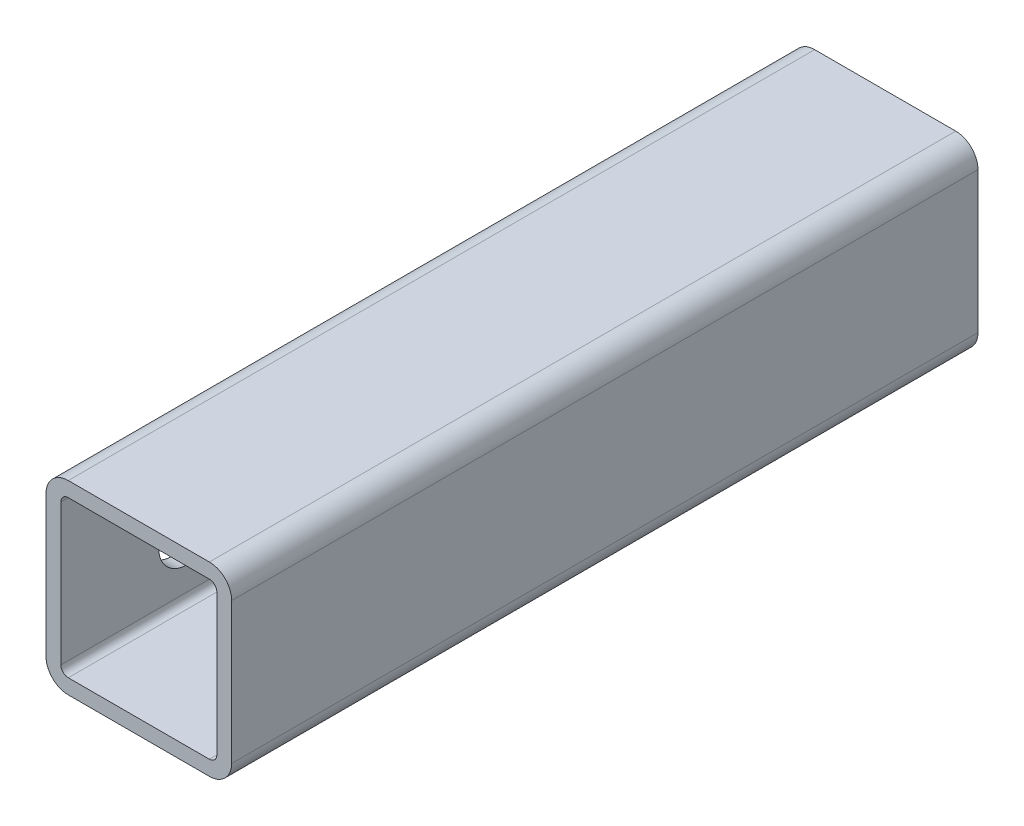
ISO-10303-21;
HEADER;
FILE_DESCRIPTION(('STEP AP214'),'2;1');
FILE_NAME('part.step','',(''),(''),'','','');
FILE_SCHEMA(('AUTOMOTIVE_DESIGN { 1 0 10303 214 1 1 1 1 }'));
ENDSEC;
DATA;
#1=APPLICATION_CONTEXT('core data for automotive mechanical design processes');
#2=APPLICATION_PROTOCOL_DEFINITION('international standard','automotive_design',2000,#1);
#3=PRODUCT_CONTEXT('',#1,'mechanical');
#4=PRODUCT('Part','Part','',(#3));
#5=PRODUCT_RELATED_PRODUCT_CATEGORY('part','',(#4));
#6=PRODUCT_DEFINITION_FORMATION('','',#4);
#7=PRODUCT_DEFINITION_CONTEXT('part definition',#1,'design');
#8=PRODUCT_DEFINITION('design','',#6,#7);
#9=PRODUCT_DEFINITION_SHAPE('','',#8);
#10=(LENGTH_UNIT() NAMED_UNIT(*) SI_UNIT(.MILLI.,.METRE.));
#11=(NAMED_UNIT(*) PLANE_ANGLE_UNIT() SI_UNIT($,.RADIAN.));
#12=(NAMED_UNIT(*) SI_UNIT($,.STERADIAN.) SOLID_ANGLE_UNIT());
#13=UNCERTAINTY_MEASURE_WITH_UNIT(LENGTH_MEASURE(1.E-05),#10,'distance_accuracy_value','');
#14=(GEOMETRIC_REPRESENTATION_CONTEXT(3) GLOBAL_UNCERTAINTY_ASSIGNED_CONTEXT((#13)) GLOBAL_UNIT_ASSIGNED_CONTEXT((#10,
#11,#12)) REPRESENTATION_CONTEXT('',''));
#15=CARTESIAN_POINT('',(0.,0.,0.));
#16=DIRECTION('',(0.,0.,1.));
#17=DIRECTION('',(1.,0.,0.));
#18=AXIS2_PLACEMENT_3D('',#15,#16,#17);
#19=CARTESIAN_POINT('',(8.57536264220471E-12,-1.16529008664656E-11,100.499999999996));
#20=DIRECTION('',(0.,0.,1.));
#21=DIRECTION('',(0.,-1.,0.));
#22=AXIS2_PLACEMENT_3D('',#19,#20,#21);
#23=PLANE('',#22);
#24=DIRECTION('',(0.,1.,0.));
#25=VECTOR('',#24,1.);
#26=CARTESIAN_POINT('',(-12.4999999999914,-4.75000000001167,100.499999999996));
#27=LINE('',#26,#25);
#28=CARTESIAN_POINT('',(-12.4999999999914,-9.50000000001168,100.499999999996));
#29=VERTEX_POINT('',#28);
#30=CARTESIAN_POINT('',(-12.4999999999914,9.4999999999883,100.499999999996));
#31=VERTEX_POINT('',#30);
#32=EDGE_CURVE('E360',#29,#31,#27,.T.);
#33=ORIENTED_EDGE('',*,*,#32,.F.);
#34=CARTESIAN_POINT('',(-9.49999999999142,-9.50000000001168,100.499999999996));
#35=DIRECTION('',(0.,0.,-1.));
#36=DIRECTION('',(1.,0.,0.));
#37=AXIS2_PLACEMENT_3D('',#34,#35,#36);
#38=CIRCLE('',#37,3.);
#39=CARTESIAN_POINT('',(-9.49999999999142,-12.5000000000117,100.499999999996));
#40=VERTEX_POINT('',#39);
#41=EDGE_CURVE('E173',#40,#29,#38,.T.);
#42=ORIENTED_EDGE('',*,*,#41,.F.);
#43=DIRECTION('',(-1.,0.,0.));
#44=VECTOR('',#43,1.);
#45=CARTESIAN_POINT('',(4.75000000000858,-12.5000000000117,100.499999999996));
#46=LINE('',#45,#44);
#47=CARTESIAN_POINT('',(9.50000000000857,-12.5000000000117,100.499999999996));
#48=VERTEX_POINT('',#47);
#49=EDGE_CURVE('E150',#48,#40,#46,.T.);
#50=ORIENTED_EDGE('',*,*,#49,.F.);
#51=CARTESIAN_POINT('',(9.50000000000858,-9.50000000001168,100.499999999996));
#52=DIRECTION('',(0.,0.,-1.));
#53=DIRECTION('',(0.,1.,0.));
#54=AXIS2_PLACEMENT_3D('',#51,#52,#53);
#55=CIRCLE('',#54,3.);
#56=CARTESIAN_POINT('',(12.5000000000086,-9.50000000001175,100.499999999996));
#57=VERTEX_POINT('',#56);
#58=EDGE_CURVE('E289',#57,#48,#55,.T.);
#59=ORIENTED_EDGE('',*,*,#58,.F.);
#60=DIRECTION('',(0.,-1.,0.));
#61=VECTOR('',#60,1.);
#62=CARTESIAN_POINT('',(12.5000000000086,4.74999999998822,100.499999999996));
#63=LINE('',#62,#61);
#64=CARTESIAN_POINT('',(12.5000000000086,9.49999999998823,100.499999999996));
#65=VERTEX_POINT('',#64);
#66=EDGE_CURVE('E321',#65,#57,#63,.T.);
#67=ORIENTED_EDGE('',*,*,#66,.F.);
#68=CARTESIAN_POINT('',(9.50000000000857,9.49999999998838,100.499999999996));
#69=DIRECTION('',(0.,0.,-1.));
#70=DIRECTION('',(-1.,0.,0.));
#71=AXIS2_PLACEMENT_3D('',#68,#69,#70);
#72=CIRCLE('',#71,3.);
#73=CARTESIAN_POINT('',(9.50000000000858,12.4999999999883,100.499999999996));
#74=VERTEX_POINT('',#73);
#75=EDGE_CURVE('E27',#74,#65,#72,.T.);
#76=ORIENTED_EDGE('',*,*,#75,.F.);
#77=DIRECTION('',(1.,0.,0.));
#78=VECTOR('',#77,1.);
#79=CARTESIAN_POINT('',(-4.74999999999142,12.4999999999883,100.499999999996));
#80=LINE('',#79,#78);
#81=CARTESIAN_POINT('',(-9.49999999999142,12.4999999999883,100.499999999996));
#82=VERTEX_POINT('',#81);
#83=EDGE_CURVE('E182',#82,#74,#80,.T.);
#84=ORIENTED_EDGE('',*,*,#83,.F.);
#85=CARTESIAN_POINT('',(-9.49999999999142,9.49999999998838,100.499999999996));
#86=DIRECTION('',(0.,0.,-1.));
#87=DIRECTION('',(0.,-1.,0.));
#88=AXIS2_PLACEMENT_3D('',#85,#86,#87);
#89=CIRCLE('',#88,3.);
#90=EDGE_CURVE('E192',#31,#82,#89,.T.);
#91=ORIENTED_EDGE('',*,*,#90,.F.);
#92=EDGE_LOOP('',(#33,#42,#50,#59,#67,#76,#84,#91));
#93=FACE_BOUND('',#92,.T.);
#94=DIRECTION('',(-1.,0.,0.));
#95=VECTOR('',#94,1.);
#96=CARTESIAN_POINT('',(-4.74999999999143,10.4999999999883,100.499999999996));
#97=LINE('',#96,#95);
#98=CARTESIAN_POINT('',(9.50000000000858,10.4999999999883,100.499999999996));
#99=VERTEX_POINT('',#98);
#100=CARTESIAN_POINT('',(-9.49999999999142,10.4999999999883,100.499999999996));
#101=VERTEX_POINT('',#100);
#102=EDGE_CURVE('E113',#99,#101,#97,.T.);
#103=ORIENTED_EDGE('',*,*,#102,.F.);
#104=CARTESIAN_POINT('',(9.50000000000857,9.49999999998838,100.499999999996));
#105=DIRECTION('',(0.,0.,1.));
#106=DIRECTION('',(-1.,0.,0.));
#107=AXIS2_PLACEMENT_3D('',#104,#105,#106);
#108=CIRCLE('',#107,1.);
#109=CARTESIAN_POINT('',(10.5000000000086,9.49999999998838,100.499999999996));
#110=VERTEX_POINT('',#109);
#111=EDGE_CURVE('E106',#110,#99,#108,.T.);
#112=ORIENTED_EDGE('',*,*,#111,.F.);
#113=DIRECTION('',(0.,1.,0.));
#114=VECTOR('',#113,1.);
#115=CARTESIAN_POINT('',(10.5000000000086,4.74999999998836,100.499999999996));
#116=LINE('',#115,#114);
#117=CARTESIAN_POINT('',(10.5000000000086,-9.50000000001161,100.499999999996));
#118=VERTEX_POINT('',#117);
#119=EDGE_CURVE('E110',#118,#110,#116,.T.);
#120=ORIENTED_EDGE('',*,*,#119,.F.);
#121=CARTESIAN_POINT('',(9.50000000000858,-9.50000000001168,100.499999999996));
#122=DIRECTION('',(0.,0.,1.));
#123=DIRECTION('',(0.,1.,0.));
#124=AXIS2_PLACEMENT_3D('',#121,#122,#123);
#125=CIRCLE('',#124,1.);
#126=CARTESIAN_POINT('',(9.50000000000857,-10.5000000000116,100.499999999996));
#127=VERTEX_POINT('',#126);
#128=EDGE_CURVE('E194',#127,#118,#125,.T.);
#129=ORIENTED_EDGE('',*,*,#128,.F.);
#130=DIRECTION('',(1.,0.,0.));
#131=VECTOR('',#130,1.);
#132=CARTESIAN_POINT('',(4.75000000000858,-10.5000000000117,100.499999999996));
#133=LINE('',#132,#131);
#134=CARTESIAN_POINT('',(-9.49999999999142,-10.5000000000116,100.499999999996));
#135=VERTEX_POINT('',#134);
#136=EDGE_CURVE('E161',#135,#127,#133,.T.);
#137=ORIENTED_EDGE('',*,*,#136,.F.);
#138=CARTESIAN_POINT('',(-9.49999999999142,-9.50000000001168,100.499999999996));
#139=DIRECTION('',(0.,0.,1.));
#140=DIRECTION('',(1.,0.,0.));
#141=AXIS2_PLACEMENT_3D('',#138,#139,#140);
#142=CIRCLE('',#141,1.);
#143=CARTESIAN_POINT('',(-10.4999999999914,-9.50000000001168,100.499999999996));
#144=VERTEX_POINT('',#143);
#145=EDGE_CURVE('E285',#144,#135,#142,.T.);
#146=ORIENTED_EDGE('',*,*,#145,.F.);
#147=DIRECTION('',(0.,-1.,0.));
#148=VECTOR('',#147,1.);
#149=CARTESIAN_POINT('',(-10.4999999999914,-4.75000000001167,100.499999999996));
#150=LINE('',#149,#148);
#151=CARTESIAN_POINT('',(-10.4999999999914,9.4999999999883,100.499999999996));
#152=VERTEX_POINT('',#151);
#153=EDGE_CURVE('E20',#152,#144,#150,.T.);
#154=ORIENTED_EDGE('',*,*,#153,.F.);
#155=CARTESIAN_POINT('',(-9.49999999999142,9.49999999998838,100.499999999996));
#156=DIRECTION('',(0.,0.,1.));
#157=DIRECTION('',(0.,-1.,0.));
#158=AXIS2_PLACEMENT_3D('',#155,#156,#157);
#159=CIRCLE('',#158,1.);
#160=EDGE_CURVE('E372',#101,#152,#159,.T.);
#161=ORIENTED_EDGE('',*,*,#160,.F.);
#162=EDGE_LOOP('',(#103,#112,#120,#129,#137,#146,#154,#161));
#163=FACE_BOUND('',#162,.T.);
#164=ADVANCED_FACE('F16',(#93,#163),#23,.T.);
#165=CARTESIAN_POINT('',(8.57092175010621E-12,-1.16529008664656E-11,-3.5527136788005E-12));
#166=DIRECTION('',(0.,0.,1.));
#167=DIRECTION('',(0.,-1.,0.));
#168=AXIS2_PLACEMENT_3D('',#165,#166,#167);
#169=PLANE('',#168);
#170=DIRECTION('',(0.,1.,0.));
#171=VECTOR('',#170,1.);
#172=CARTESIAN_POINT('',(-12.4999999999914,-4.75000000001167,-3.5527136788005E-12));
#173=LINE('',#172,#171);
#174=CARTESIAN_POINT('',(-12.4999999999914,-9.50000000001168,-3.5527136788005E-12));
#175=VERTEX_POINT('',#174);
#176=CARTESIAN_POINT('',(-12.4999999999914,9.4999999999883,-3.5527136788005E-12));
#177=VERTEX_POINT('',#176);
#178=EDGE_CURVE('E188',#175,#177,#173,.T.);
#179=ORIENTED_EDGE('',*,*,#178,.T.);
#180=CARTESIAN_POINT('',(-9.49999999999142,9.49999999998838,-3.5527136788005E-12));
#181=DIRECTION('',(0.,0.,-1.));
#182=DIRECTION('',(0.,-1.,0.));
#183=AXIS2_PLACEMENT_3D('',#180,#181,#182);
#184=CIRCLE('',#183,3.);
#185=CARTESIAN_POINT('',(-9.49999999999142,12.4999999999883,-3.5527136788005E-12));
#186=VERTEX_POINT('',#185);
#187=EDGE_CURVE('E178',#177,#186,#184,.T.);
#188=ORIENTED_EDGE('',*,*,#187,.T.);
#189=DIRECTION('',(1.,0.,0.));
#190=VECTOR('',#189,1.);
#191=CARTESIAN_POINT('',(-4.74999999999142,12.4999999999883,-3.5527136788005E-12));
#192=LINE('',#191,#190);
#193=CARTESIAN_POINT('',(9.50000000000857,12.4999999999883,-3.5527136788005E-12));
#194=VERTEX_POINT('',#193);
#195=EDGE_CURVE('E165',#186,#194,#192,.T.);
#196=ORIENTED_EDGE('',*,*,#195,.T.);
#197=CARTESIAN_POINT('',(9.50000000000857,9.49999999998838,-3.5527136788005E-12));
#198=DIRECTION('',(0.,0.,-1.));
#199=DIRECTION('',(-1.,0.,0.));
#200=AXIS2_PLACEMENT_3D('',#197,#198,#199);
#201=CIRCLE('',#200,3.);
#202=CARTESIAN_POINT('',(12.5000000000086,9.49999999998823,-3.5527136788005E-12));
#203=VERTEX_POINT('',#202);
#204=EDGE_CURVE('E11',#194,#203,#201,.T.);
#205=ORIENTED_EDGE('',*,*,#204,.T.);
#206=DIRECTION('',(0.,-1.,0.));
#207=VECTOR('',#206,1.);
#208=CARTESIAN_POINT('',(12.5000000000086,4.74999999998822,-3.5527136788005E-12));
#209=LINE('',#208,#207);
#210=CARTESIAN_POINT('',(12.5000000000086,-9.50000000001175,-3.5527136788005E-12));
#211=VERTEX_POINT('',#210);
#212=EDGE_CURVE('E306',#203,#211,#209,.T.);
#213=ORIENTED_EDGE('',*,*,#212,.T.);
#214=CARTESIAN_POINT('',(9.50000000000858,-9.50000000001168,-3.5527136788005E-12));
#215=DIRECTION('',(0.,0.,-1.));
#216=DIRECTION('',(0.,1.,0.));
#217=AXIS2_PLACEMENT_3D('',#214,#215,#216);
#218=CIRCLE('',#217,3.);
#219=CARTESIAN_POINT('',(9.50000000000857,-12.5000000000117,-3.5527136788005E-12));
#220=VERTEX_POINT('',#219);
#221=EDGE_CURVE('E200',#211,#220,#218,.T.);
#222=ORIENTED_EDGE('',*,*,#221,.T.);
#223=DIRECTION('',(-1.,0.,0.));
#224=VECTOR('',#223,1.);
#225=CARTESIAN_POINT('',(4.75000000000858,-12.5000000000117,-3.5527136788005E-12));
#226=LINE('',#225,#224);
#227=CARTESIAN_POINT('',(-9.49999999999142,-12.5000000000117,-3.5527136788005E-12));
#228=VERTEX_POINT('',#227);
#229=EDGE_CURVE('E149',#220,#228,#226,.T.);
#230=ORIENTED_EDGE('',*,*,#229,.T.);
#231=CARTESIAN_POINT('',(-9.49999999999142,-9.50000000001168,-3.5527136788005E-12));
#232=DIRECTION('',(0.,0.,-1.));
#233=DIRECTION('',(1.,0.,0.));
#234=AXIS2_PLACEMENT_3D('',#231,#232,#233);
#235=CIRCLE('',#234,3.);
#236=EDGE_CURVE('E408',#228,#175,#235,.T.);
#237=ORIENTED_EDGE('',*,*,#236,.T.);
#238=EDGE_LOOP('',(#179,#188,#196,#205,#213,#222,#230,#237));
#239=FACE_BOUND('',#238,.T.);
#240=DIRECTION('',(-1.,0.,0.));
#241=VECTOR('',#240,1.);
#242=CARTESIAN_POINT('',(-4.74999999999142,10.4999999999883,-3.5527136788005E-12));
#243=LINE('',#242,#241);
#244=CARTESIAN_POINT('',(9.50000000000858,10.4999999999883,-3.5527136788005E-12));
#245=VERTEX_POINT('',#244);
#246=CARTESIAN_POINT('',(-9.49999999999142,10.4999999999883,-3.5527136788005E-12));
#247=VERTEX_POINT('',#246);
#248=EDGE_CURVE('E155',#245,#247,#243,.T.);
#249=ORIENTED_EDGE('',*,*,#248,.T.);
#250=CARTESIAN_POINT('',(-9.49999999999142,9.49999999998838,-3.5527136788005E-12));
#251=DIRECTION('',(0.,0.,1.));
#252=DIRECTION('',(0.,-1.,0.));
#253=AXIS2_PLACEMENT_3D('',#250,#251,#252);
#254=CIRCLE('',#253,1.);
#255=CARTESIAN_POINT('',(-10.4999999999914,9.4999999999883,-3.5527136788005E-12));
#256=VERTEX_POINT('',#255);
#257=EDGE_CURVE('E279',#247,#256,#254,.T.);
#258=ORIENTED_EDGE('',*,*,#257,.T.);
#259=DIRECTION('',(0.,-1.,0.));
#260=VECTOR('',#259,1.);
#261=CARTESIAN_POINT('',(-10.4999999999914,-4.75000000001167,-3.5527136788005E-12));
#262=LINE('',#261,#260);
#263=CARTESIAN_POINT('',(-10.4999999999914,-9.50000000001168,-3.5527136788005E-12));
#264=VERTEX_POINT('',#263);
#265=EDGE_CURVE('E385',#256,#264,#262,.T.);
#266=ORIENTED_EDGE('',*,*,#265,.T.);
#267=CARTESIAN_POINT('',(-9.49999999999142,-9.50000000001168,-3.5527136788005E-12));
#268=DIRECTION('',(0.,0.,1.));
#269=DIRECTION('',(1.,0.,0.));
#270=AXIS2_PLACEMENT_3D('',#267,#268,#269);
#271=CIRCLE('',#270,1.);
#272=CARTESIAN_POINT('',(-9.49999999999142,-10.5000000000116,-3.5527136788005E-12));
#273=VERTEX_POINT('',#272);
#274=EDGE_CURVE('E170',#264,#273,#271,.T.);
#275=ORIENTED_EDGE('',*,*,#274,.T.);
#276=DIRECTION('',(1.,0.,0.));
#277=VECTOR('',#276,1.);
#278=CARTESIAN_POINT('',(4.75000000000858,-10.5000000000117,-3.5527136788005E-12));
#279=LINE('',#278,#277);
#280=CARTESIAN_POINT('',(9.50000000000857,-10.5000000000116,-3.5527136788005E-12));
#281=VERTEX_POINT('',#280);
#282=EDGE_CURVE('E160',#273,#281,#279,.T.);
#283=ORIENTED_EDGE('',*,*,#282,.T.);
#284=CARTESIAN_POINT('',(9.50000000000858,-9.50000000001168,-3.5527136788005E-12));
#285=DIRECTION('',(0.,0.,1.));
#286=DIRECTION('',(0.,1.,0.));
#287=AXIS2_PLACEMENT_3D('',#284,#285,#286);
#288=CIRCLE('',#287,1.);
#289=CARTESIAN_POINT('',(10.5000000000086,-9.50000000001161,-3.5527136788005E-12));
#290=VERTEX_POINT('',#289);
#291=EDGE_CURVE('E134',#281,#290,#288,.T.);
#292=ORIENTED_EDGE('',*,*,#291,.T.);
#293=DIRECTION('',(0.,1.,0.));
#294=VECTOR('',#293,1.);
#295=CARTESIAN_POINT('',(10.5000000000086,4.74999999998836,-3.5527136788005E-12));
#296=LINE('',#295,#294);
#297=CARTESIAN_POINT('',(10.5000000000086,9.49999999998838,-3.5527136788005E-12));
#298=VERTEX_POINT('',#297);
#299=EDGE_CURVE('E119',#290,#298,#296,.T.);
#300=ORIENTED_EDGE('',*,*,#299,.T.);
#301=CARTESIAN_POINT('',(9.50000000000857,9.49999999998838,-3.5527136788005E-12));
#302=DIRECTION('',(0.,0.,1.));
#303=DIRECTION('',(-1.,0.,0.));
#304=AXIS2_PLACEMENT_3D('',#301,#302,#303);
#305=CIRCLE('',#304,1.);
#306=EDGE_CURVE('E125',#298,#245,#305,.T.);
#307=ORIENTED_EDGE('',*,*,#306,.T.);
#308=EDGE_LOOP('',(#249,#258,#266,#275,#283,#292,#300,#307));
#309=FACE_BOUND('',#308,.T.);
#310=ADVANCED_FACE('F635',(#239,#309),#169,.F.);
#311=CARTESIAN_POINT('',(9.50000000000857,9.49999999998838,-3.5527136788005E-12));
#312=DIRECTION('',(0.,0.,1.));
#313=DIRECTION('',(-1.,0.,0.));
#314=AXIS2_PLACEMENT_3D('',#311,#312,#313);
#315=CYLINDRICAL_SURFACE('',#314,3.);
#316=ORIENTED_EDGE('',*,*,#75,.T.);
#317=DIRECTION('',(0.,0.,1.));
#318=VECTOR('',#317,1.);
#319=CARTESIAN_POINT('',(12.5000000000086,9.49999999998823,-3.5527136788005E-12));
#320=LINE('',#319,#318);
#321=EDGE_CURVE('E294',#203,#65,#320,.T.);
#322=ORIENTED_EDGE('',*,*,#321,.F.);
#323=ORIENTED_EDGE('',*,*,#204,.F.);
#324=DIRECTION('',(0.,0.,1.));
#325=VECTOR('',#324,1.);
#326=CARTESIAN_POINT('',(9.50000000000857,12.4999999999883,-3.5527136788005E-12));
#327=LINE('',#326,#325);
#328=EDGE_CURVE('E186',#194,#74,#327,.T.);
#329=ORIENTED_EDGE('',*,*,#328,.T.);
#330=EDGE_LOOP('',(#316,#322,#323,#329));
#331=FACE_BOUND('',#330,.T.);
#332=ADVANCED_FACE('F625',(#331),#315,.T.);
#333=CARTESIAN_POINT('',(-9.49999999999142,12.4999999999883,-3.5527136788005E-12));
#334=DIRECTION('',(0.,1.,0.));
#335=DIRECTION('',(1.,0.,0.));
#336=AXIS2_PLACEMENT_3D('',#333,#334,#335);
#337=PLANE('',#336);
#338=ORIENTED_EDGE('',*,*,#83,.T.);
#339=ORIENTED_EDGE('',*,*,#328,.F.);
#340=ORIENTED_EDGE('',*,*,#195,.F.);
#341=DIRECTION('',(0.,0.,1.));
#342=VECTOR('',#341,1.);
#343=CARTESIAN_POINT('',(-9.49999999999142,12.4999999999883,-3.5527136788005E-12));
#344=LINE('',#343,#342);
#345=EDGE_CURVE('E183',#186,#82,#344,.T.);
#346=ORIENTED_EDGE('',*,*,#345,.T.);
#347=EDGE_LOOP('',(#338,#339,#340,#346));
#348=FACE_BOUND('',#347,.T.);
#349=ADVANCED_FACE('F615',(#348),#337,.T.);
#350=CARTESIAN_POINT('',(-9.49999999999142,9.49999999998838,-3.5527136788005E-12));
#351=DIRECTION('',(0.,0.,1.));
#352=DIRECTION('',(0.,-1.,0.));
#353=AXIS2_PLACEMENT_3D('',#350,#351,#352);
#354=CYLINDRICAL_SURFACE('',#353,3.);
#355=ORIENTED_EDGE('',*,*,#90,.T.);
#356=ORIENTED_EDGE('',*,*,#345,.F.);
#357=ORIENTED_EDGE('',*,*,#187,.F.);
#358=DIRECTION('',(0.,0.,1.));
#359=VECTOR('',#358,1.);
#360=CARTESIAN_POINT('',(-12.4999999999914,9.4999999999883,-3.5527136788005E-12));
#361=LINE('',#360,#359);
#362=EDGE_CURVE('E193',#177,#31,#361,.T.);
#363=ORIENTED_EDGE('',*,*,#362,.T.);
#364=EDGE_LOOP('',(#355,#356,#357,#363));
#365=FACE_BOUND('',#364,.T.);
#366=ADVANCED_FACE('F605',(#365),#354,.T.);
#367=CARTESIAN_POINT('',(-12.4999999999914,-9.50000000001168,-3.5527136788005E-12));
#368=DIRECTION('',(-1.,0.,0.));
#369=DIRECTION('',(0.,1.,0.));
#370=AXIS2_PLACEMENT_3D('',#367,#368,#369);
#371=PLANE('',#370);
#372=ORIENTED_EDGE('',*,*,#32,.T.);
#373=ORIENTED_EDGE('',*,*,#362,.F.);
#374=ORIENTED_EDGE('',*,*,#178,.F.);
#375=DIRECTION('',(0.,0.,1.));
#376=VECTOR('',#375,1.);
#377=CARTESIAN_POINT('',(-12.4999999999914,-9.50000000001168,-3.5527136788005E-12));
#378=LINE('',#377,#376);
#379=EDGE_CURVE('E177',#175,#29,#378,.T.);
#380=ORIENTED_EDGE('',*,*,#379,.T.);
#381=EDGE_LOOP('',(#372,#373,#374,#380));
#382=FACE_BOUND('',#381,.T.);
#383=CARTESIAN_POINT('',(-12.4999999999914,-2.50000000001073,35.4999999999956));
#384=DIRECTION('',(1.,0.,0.));
#385=DIRECTION('',(0.,-1.,0.));
#386=AXIS2_PLACEMENT_3D('',#383,#384,#385);
#387=CIRCLE('',#386,3.8235);
#388=CARTESIAN_POINT('',(-12.4999999999914,-6.32350000001075,35.4999999999956));
#389=VERTEX_POINT('',#388);
#390=EDGE_CURVE('E241',#389,#389,#387,.T.);
#391=ORIENTED_EDGE('',*,*,#390,.T.);
#392=EDGE_LOOP('',(#391));
#393=FACE_BOUND('',#392,.T.);
#394=CARTESIAN_POINT('',(-12.4999999999914,-2.5000000000049,83.4999999999973));
#395=DIRECTION('',(1.,0.,0.));
#396=DIRECTION('',(0.,-1.,0.));
#397=AXIS2_PLACEMENT_3D('',#394,#395,#396);
#398=CIRCLE('',#397,3.8235);
#399=CARTESIAN_POINT('',(-12.4999999999914,-6.32350000000493,83.4999999999973));
#400=VERTEX_POINT('',#399);
#401=EDGE_CURVE('E258',#400,#400,#398,.T.);
#402=ORIENTED_EDGE('',*,*,#401,.T.);
#403=EDGE_LOOP('',(#402));
#404=FACE_BOUND('',#403,.T.);
#405=ADVANCED_FACE('F595',(#382,#393,#404),#371,.T.);
#406=CARTESIAN_POINT('',(-9.49999999999142,9.49999999998838,-3.5527136788005E-12));
#407=DIRECTION('',(0.,0.,1.));
#408=DIRECTION('',(0.,-1.,0.));
#409=AXIS2_PLACEMENT_3D('',#406,#407,#408);
#410=CYLINDRICAL_SURFACE('',#409,1.);
#411=ORIENTED_EDGE('',*,*,#160,.T.);
#412=DIRECTION('',(0.,0.,1.));
#413=VECTOR('',#412,1.);
#414=CARTESIAN_POINT('',(-10.4999999999914,9.4999999999883,-3.5527136788005E-12));
#415=LINE('',#414,#413);
#416=EDGE_CURVE('E377',#256,#152,#415,.T.);
#417=ORIENTED_EDGE('',*,*,#416,.F.);
#418=ORIENTED_EDGE('',*,*,#257,.F.);
#419=DIRECTION('',(0.,0.,1.));
#420=VECTOR('',#419,1.);
#421=CARTESIAN_POINT('',(-9.49999999999142,10.4999999999883,-3.5527136788005E-12));
#422=LINE('',#421,#420);
#423=EDGE_CURVE('E151',#247,#101,#422,.T.);
#424=ORIENTED_EDGE('',*,*,#423,.T.);
#425=EDGE_LOOP('',(#411,#417,#418,#424));
#426=FACE_BOUND('',#425,.T.);
#427=ADVANCED_FACE('F584',(#426),#410,.F.);
#428=CARTESIAN_POINT('',(-10.4999999999914,-9.50000000001168,-3.5527136788005E-12));
#429=DIRECTION('',(-1.,0.,0.));
#430=DIRECTION('',(0.,0.,1.));
#431=AXIS2_PLACEMENT_3D('',#428,#429,#430);
#432=PLANE('',#431);
#433=ORIENTED_EDGE('',*,*,#153,.T.);
#434=DIRECTION('',(0.,0.,1.));
#435=VECTOR('',#434,1.);
#436=CARTESIAN_POINT('',(-10.4999999999914,-9.50000000001168,-3.5527136788005E-12));
#437=LINE('',#436,#435);
#438=EDGE_CURVE('E166',#264,#144,#437,.T.);
#439=ORIENTED_EDGE('',*,*,#438,.F.);
#440=ORIENTED_EDGE('',*,*,#265,.F.);
#441=ORIENTED_EDGE('',*,*,#416,.T.);
#442=EDGE_LOOP('',(#433,#439,#440,#441));
#443=FACE_BOUND('',#442,.T.);
#444=CARTESIAN_POINT('',(-10.4999999999914,-2.50000000001073,35.4999999999956));
#445=DIRECTION('',(-1.,0.,0.));
#446=DIRECTION('',(0.,-1.,0.));
#447=AXIS2_PLACEMENT_3D('',#444,#445,#446);
#448=CIRCLE('',#447,3.8235);
#449=CARTESIAN_POINT('',(-10.4999999999914,1.32349999998929,35.4999999999956));
#450=VERTEX_POINT('',#449);
#451=EDGE_CURVE('E249',#450,#450,#448,.T.);
#452=ORIENTED_EDGE('',*,*,#451,.T.);
#453=EDGE_LOOP('',(#452));
#454=FACE_BOUND('',#453,.T.);
#455=CARTESIAN_POINT('',(-10.4999999999914,-2.5000000000049,83.4999999999973));
#456=DIRECTION('',(-1.,0.,0.));
#457=DIRECTION('',(0.,-1.,0.));
#458=AXIS2_PLACEMENT_3D('',#455,#456,#457);
#459=CIRCLE('',#458,3.8235);
#460=CARTESIAN_POINT('',(-10.4999999999914,1.32349999999512,83.4999999999973));
#461=VERTEX_POINT('',#460);
#462=EDGE_CURVE('E267',#461,#461,#459,.T.);
#463=ORIENTED_EDGE('',*,*,#462,.T.);
#464=EDGE_LOOP('',(#463));
#465=FACE_BOUND('',#464,.T.);
#466=ADVANCED_FACE('F573',(#443,#454,#465),#432,.F.);
#467=CARTESIAN_POINT('',(-9.49999999999142,-9.50000000001168,-3.5527136788005E-12));
#468=DIRECTION('',(0.,0.,1.));
#469=DIRECTION('',(1.,0.,0.));
#470=AXIS2_PLACEMENT_3D('',#467,#468,#469);
#471=CYLINDRICAL_SURFACE('',#470,1.);
#472=ORIENTED_EDGE('',*,*,#145,.T.);
#473=DIRECTION('',(0.,0.,1.));
#474=VECTOR('',#473,1.);
#475=CARTESIAN_POINT('',(-9.49999999999142,-10.5000000000116,-3.5527136788005E-12));
#476=LINE('',#475,#474);
#477=EDGE_CURVE('E197',#273,#135,#476,.T.);
#478=ORIENTED_EDGE('',*,*,#477,.F.);
#479=ORIENTED_EDGE('',*,*,#274,.F.);
#480=ORIENTED_EDGE('',*,*,#438,.T.);
#481=EDGE_LOOP('',(#472,#478,#479,#480));
#482=FACE_BOUND('',#481,.T.);
#483=ADVANCED_FACE('F562',(#482),#471,.F.);
#484=CARTESIAN_POINT('',(-9.49999999999142,10.4999999999883,-3.5527136788005E-12));
#485=DIRECTION('',(0.,1.,0.));
#486=DIRECTION('',(1.,0.,0.));
#487=AXIS2_PLACEMENT_3D('',#484,#485,#486);
#488=PLANE('',#487);
#489=ORIENTED_EDGE('',*,*,#102,.T.);
#490=ORIENTED_EDGE('',*,*,#423,.F.);
#491=ORIENTED_EDGE('',*,*,#248,.F.);
#492=DIRECTION('',(0.,0.,1.));
#493=VECTOR('',#492,1.);
#494=CARTESIAN_POINT('',(9.50000000000858,10.4999999999883,-3.5527136788005E-12));
#495=LINE('',#494,#493);
#496=EDGE_CURVE('E118',#245,#99,#495,.T.);
#497=ORIENTED_EDGE('',*,*,#496,.T.);
#498=EDGE_LOOP('',(#489,#490,#491,#497));
#499=FACE_BOUND('',#498,.T.);
#500=ADVANCED_FACE('F552',(#499),#488,.F.);
#501=CARTESIAN_POINT('',(-9.49999999999142,-9.50000000001168,-3.5527136788005E-12));
#502=DIRECTION('',(0.,0.,1.));
#503=DIRECTION('',(1.,0.,0.));
#504=AXIS2_PLACEMENT_3D('',#501,#502,#503);
#505=CYLINDRICAL_SURFACE('',#504,3.);
#506=ORIENTED_EDGE('',*,*,#41,.T.);
#507=ORIENTED_EDGE('',*,*,#379,.F.);
#508=ORIENTED_EDGE('',*,*,#236,.F.);
#509=DIRECTION('',(0.,0.,1.));
#510=VECTOR('',#509,1.);
#511=CARTESIAN_POINT('',(-9.49999999999142,-12.5000000000117,-3.5527136788005E-12));
#512=LINE('',#511,#510);
#513=EDGE_CURVE('E145',#228,#40,#512,.T.);
#514=ORIENTED_EDGE('',*,*,#513,.T.);
#515=EDGE_LOOP('',(#506,#507,#508,#514));
#516=FACE_BOUND('',#515,.T.);
#517=ADVANCED_FACE('F541',(#516),#505,.T.);
#518=CARTESIAN_POINT('',(9.50000000000857,-12.5000000000117,-3.5527136788005E-12));
#519=DIRECTION('',(0.,-1.,0.));
#520=DIRECTION('',(0.,0.,-1.));
#521=AXIS2_PLACEMENT_3D('',#518,#519,#520);
#522=PLANE('',#521);
#523=ORIENTED_EDGE('',*,*,#49,.T.);
#524=ORIENTED_EDGE('',*,*,#513,.F.);
#525=ORIENTED_EDGE('',*,*,#229,.F.);
#526=DIRECTION('',(0.,0.,1.));
#527=VECTOR('',#526,1.);
#528=CARTESIAN_POINT('',(9.50000000000857,-12.5000000000117,-3.5527136788005E-12));
#529=LINE('',#528,#527);
#530=EDGE_CURVE('E293',#220,#48,#529,.T.);
#531=ORIENTED_EDGE('',*,*,#530,.T.);
#532=EDGE_LOOP('',(#523,#524,#525,#531));
#533=FACE_BOUND('',#532,.T.);
#534=ADVANCED_FACE('F529',(#533),#522,.T.);
#535=CARTESIAN_POINT('',(9.50000000000858,-9.50000000001168,-3.5527136788005E-12));
#536=DIRECTION('',(0.,0.,1.));
#537=DIRECTION('',(0.,1.,0.));
#538=AXIS2_PLACEMENT_3D('',#535,#536,#537);
#539=CYLINDRICAL_SURFACE('',#538,3.);
#540=ORIENTED_EDGE('',*,*,#58,.T.);
#541=ORIENTED_EDGE('',*,*,#530,.F.);
#542=ORIENTED_EDGE('',*,*,#221,.F.);
#543=DIRECTION('',(0.,0.,1.));
#544=VECTOR('',#543,1.);
#545=CARTESIAN_POINT('',(12.5000000000086,-9.50000000001175,-3.5527136788005E-12));
#546=LINE('',#545,#544);
#547=EDGE_CURVE('E314',#211,#57,#546,.T.);
#548=ORIENTED_EDGE('',*,*,#547,.T.);
#549=EDGE_LOOP('',(#540,#541,#542,#548));
#550=FACE_BOUND('',#549,.T.);
#551=ADVANCED_FACE('F517',(#550),#539,.T.);
#552=CARTESIAN_POINT('',(12.5000000000086,9.49999999998823,-3.5527136788005E-12));
#553=DIRECTION('',(1.,0.,0.));
#554=DIRECTION('',(0.,1.,0.));
#555=AXIS2_PLACEMENT_3D('',#552,#553,#554);
#556=PLANE('',#555);
#557=ORIENTED_EDGE('',*,*,#66,.T.);
#558=ORIENTED_EDGE('',*,*,#547,.F.);
#559=ORIENTED_EDGE('',*,*,#212,.F.);
#560=ORIENTED_EDGE('',*,*,#321,.T.);
#561=EDGE_LOOP('',(#557,#558,#559,#560));
#562=FACE_BOUND('',#561,.T.);
#563=ADVANCED_FACE('F507',(#562),#556,.T.);
#564=CARTESIAN_POINT('',(9.50000000000857,9.49999999998838,-3.5527136788005E-12));
#565=DIRECTION('',(0.,0.,1.));
#566=DIRECTION('',(-1.,0.,0.));
#567=AXIS2_PLACEMENT_3D('',#564,#565,#566);
#568=CYLINDRICAL_SURFACE('',#567,1.);
#569=ORIENTED_EDGE('',*,*,#111,.T.);
#570=ORIENTED_EDGE('',*,*,#496,.F.);
#571=ORIENTED_EDGE('',*,*,#306,.F.);
#572=DIRECTION('',(0.,0.,1.));
#573=VECTOR('',#572,1.);
#574=CARTESIAN_POINT('',(10.5000000000086,9.49999999998838,-3.5527136788005E-12));
#575=LINE('',#574,#573);
#576=EDGE_CURVE('E122',#298,#110,#575,.T.);
#577=ORIENTED_EDGE('',*,*,#576,.T.);
#578=EDGE_LOOP('',(#569,#570,#571,#577));
#579=FACE_BOUND('',#578,.T.);
#580=ADVANCED_FACE('F123',(#579),#568,.F.);
#581=CARTESIAN_POINT('',(10.5000000000086,9.49999999998838,-3.5527136788005E-12));
#582=DIRECTION('',(1.,0.,0.));
#583=DIRECTION('',(0.,-1.,0.));
#584=AXIS2_PLACEMENT_3D('',#581,#582,#583);
#585=PLANE('',#584);
#586=ORIENTED_EDGE('',*,*,#119,.T.);
#587=ORIENTED_EDGE('',*,*,#576,.F.);
#588=ORIENTED_EDGE('',*,*,#299,.F.);
#589=DIRECTION('',(0.,0.,1.));
#590=VECTOR('',#589,1.);
#591=CARTESIAN_POINT('',(10.5000000000086,-9.50000000001161,-3.5527136788005E-12));
#592=LINE('',#591,#590);
#593=EDGE_CURVE('E131',#290,#118,#592,.T.);
#594=ORIENTED_EDGE('',*,*,#593,.T.);
#595=EDGE_LOOP('',(#586,#587,#588,#594));
#596=FACE_BOUND('',#595,.T.);
#597=ADVANCED_FACE('F18',(#596),#585,.F.);
#598=CARTESIAN_POINT('',(9.50000000000858,-9.50000000001168,-3.5527136788005E-12));
#599=DIRECTION('',(0.,0.,1.));
#600=DIRECTION('',(0.,1.,0.));
#601=AXIS2_PLACEMENT_3D('',#598,#599,#600);
#602=CYLINDRICAL_SURFACE('',#601,1.);
#603=ORIENTED_EDGE('',*,*,#128,.T.);
#604=ORIENTED_EDGE('',*,*,#593,.F.);
#605=ORIENTED_EDGE('',*,*,#291,.F.);
#606=DIRECTION('',(0.,0.,1.));
#607=VECTOR('',#606,1.);
#608=CARTESIAN_POINT('',(9.50000000000857,-10.5000000000116,-3.5527136788005E-12));
#609=LINE('',#608,#607);
#610=EDGE_CURVE('E156',#281,#127,#609,.T.);
#611=ORIENTED_EDGE('',*,*,#610,.T.);
#612=EDGE_LOOP('',(#603,#604,#605,#611));
#613=FACE_BOUND('',#612,.T.);
#614=ADVANCED_FACE('F476',(#613),#602,.F.);
#615=CARTESIAN_POINT('',(9.50000000000857,-10.5000000000116,-3.5527136788005E-12));
#616=DIRECTION('',(0.,-1.,0.));
#617=DIRECTION('',(0.,0.,-1.));
#618=AXIS2_PLACEMENT_3D('',#615,#616,#617);
#619=PLANE('',#618);
#620=ORIENTED_EDGE('',*,*,#136,.T.);
#621=ORIENTED_EDGE('',*,*,#610,.F.);
#622=ORIENTED_EDGE('',*,*,#282,.F.);
#623=ORIENTED_EDGE('',*,*,#477,.T.);
#624=EDGE_LOOP('',(#620,#621,#622,#623));
#625=FACE_BOUND('',#624,.T.);
#626=ADVANCED_FACE('F464',(#625),#619,.F.);
#627=CARTESIAN_POINT('',(-8.49999999999142,-2.50000000001073,35.4999999999956));
#628=DIRECTION('',(-1.,0.,0.));
#629=DIRECTION('',(0.,-1.,0.));
#630=AXIS2_PLACEMENT_3D('',#627,#628,#629);
#631=CYLINDRICAL_SURFACE('',#630,3.8235);
#632=ORIENTED_EDGE('',*,*,#390,.F.);
#633=EDGE_LOOP('',(#632));
#634=FACE_BOUND('',#633,.T.);
#635=ORIENTED_EDGE('',*,*,#451,.F.);
#636=EDGE_LOOP('',(#635));
#637=FACE_BOUND('',#636,.T.);
#638=ADVANCED_FACE('F450',(#634,#637),#631,.F.);
#639=CARTESIAN_POINT('',(-8.49999999999142,-2.5000000000049,83.4999999999973));
#640=DIRECTION('',(-1.,0.,0.));
#641=DIRECTION('',(0.,-1.,0.));
#642=AXIS2_PLACEMENT_3D('',#639,#640,#641);
#643=CYLINDRICAL_SURFACE('',#642,3.8235);
#644=ORIENTED_EDGE('',*,*,#401,.F.);
#645=EDGE_LOOP('',(#644));
#646=FACE_BOUND('',#645,.T.);
#647=ORIENTED_EDGE('',*,*,#462,.F.);
#648=EDGE_LOOP('',(#647));
#649=FACE_BOUND('',#648,.T.);
#650=ADVANCED_FACE('F444',(#646,#649),#643,.F.);
#651=CLOSED_SHELL('',(#164,#310,#332,#349,#366,#405,#427,#466,#483,#500,#517,#534,#551,#563,
#580,#597,#614,#626,#638,#650));
#652=MANIFOLD_SOLID_BREP('B1',#651);
#653=ADVANCED_BREP_SHAPE_REPRESENTATION('',(#18,#652),#14);
#654=SHAPE_DEFINITION_REPRESENTATION(#9,#653);
ENDSEC;
END-ISO-10303-21;
